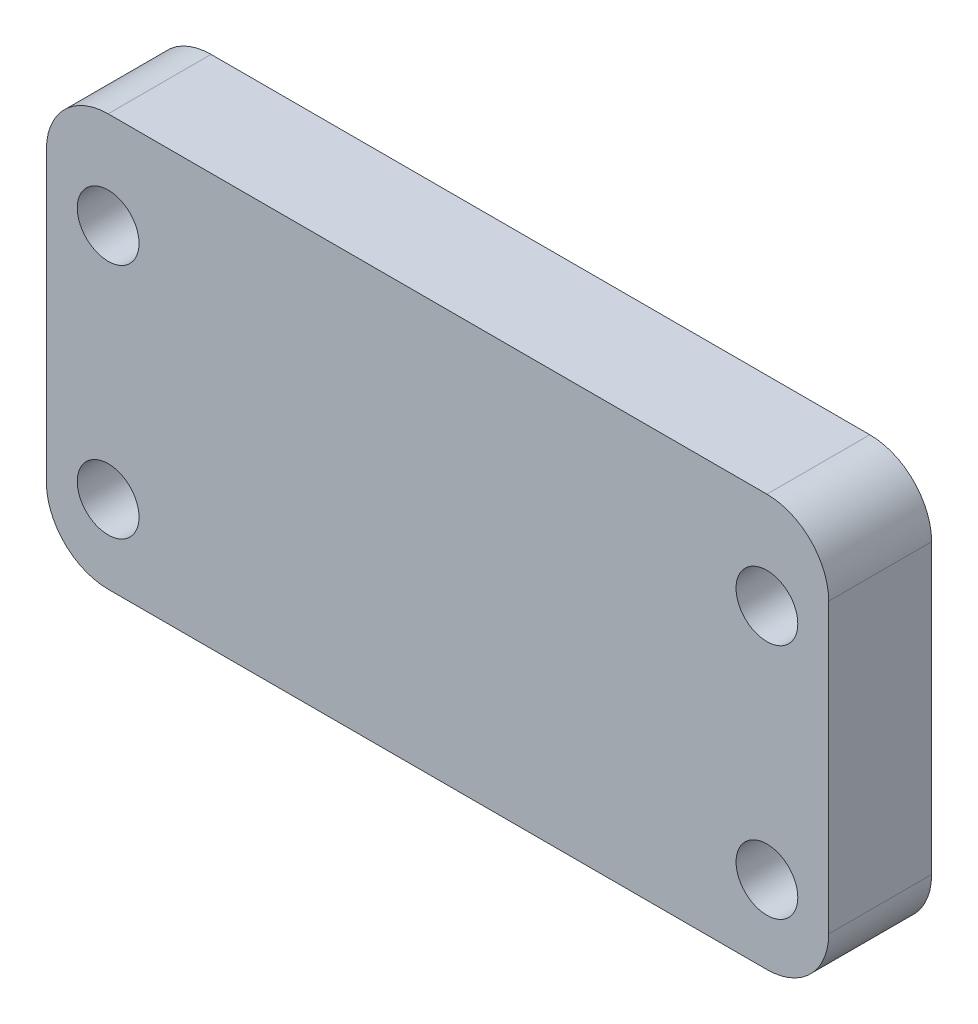
ISO-10303-21;
HEADER;
FILE_DESCRIPTION(('STEP AP214'),'2;1');
FILE_NAME('part.step','',(''),(''),'','','');
FILE_SCHEMA(('AUTOMOTIVE_DESIGN { 1 0 10303 214 1 1 1 1 }'));
ENDSEC;
DATA;
#1=APPLICATION_CONTEXT('core data for automotive mechanical design processes');
#2=APPLICATION_PROTOCOL_DEFINITION('international standard','automotive_design',2000,#1);
#3=PRODUCT_CONTEXT('',#1,'mechanical');
#4=PRODUCT('Part','Part','',(#3));
#5=PRODUCT_RELATED_PRODUCT_CATEGORY('part','',(#4));
#6=PRODUCT_DEFINITION_FORMATION('','',#4);
#7=PRODUCT_DEFINITION_CONTEXT('part definition',#1,'design');
#8=PRODUCT_DEFINITION('design','',#6,#7);
#9=PRODUCT_DEFINITION_SHAPE('','',#8);
#10=(LENGTH_UNIT() NAMED_UNIT(*) SI_UNIT(.MILLI.,.METRE.));
#11=(NAMED_UNIT(*) PLANE_ANGLE_UNIT() SI_UNIT($,.RADIAN.));
#12=(NAMED_UNIT(*) SI_UNIT($,.STERADIAN.) SOLID_ANGLE_UNIT());
#13=UNCERTAINTY_MEASURE_WITH_UNIT(LENGTH_MEASURE(1.E-05),#10,'distance_accuracy_value','');
#14=(GEOMETRIC_REPRESENTATION_CONTEXT(3) GLOBAL_UNCERTAINTY_ASSIGNED_CONTEXT((#13)) GLOBAL_UNIT_ASSIGNED_CONTEXT((#10,
#11,#12)) REPRESENTATION_CONTEXT('',''));
#15=CARTESIAN_POINT('',(0.,0.,0.));
#16=DIRECTION('',(0.,0.,1.));
#17=DIRECTION('',(1.,0.,0.));
#18=AXIS2_PLACEMENT_3D('',#15,#16,#17);
#19=CARTESIAN_POINT('',(-11.1107491856678,16.8664495114006,5.));
#20=DIRECTION('',(0.,0.,1.));
#21=DIRECTION('',(1.,0.,0.));
#22=AXIS2_PLACEMENT_3D('',#19,#20,#21);
#23=CYLINDRICAL_SURFACE('',#22,3.);
#24=DIRECTION('',(0.,0.,1.));
#25=VECTOR('',#24,1.);
#26=CARTESIAN_POINT('',(-11.1107491856678,19.8664495114006,5.));
#27=LINE('',#26,#25);
#28=CARTESIAN_POINT('',(-11.1107491856678,19.8664495114006,0.));
#29=VERTEX_POINT('',#28);
#30=CARTESIAN_POINT('',(-11.1107491856678,19.8664495114006,5.));
#31=VERTEX_POINT('',#30);
#32=EDGE_CURVE('E152',#29,#31,#27,.T.);
#33=ORIENTED_EDGE('',*,*,#32,.F.);
#34=CARTESIAN_POINT('',(-11.1107491856678,16.8664495114006,0.));
#35=DIRECTION('',(0.,0.,-1.));
#36=DIRECTION('',(-1.,0.,0.));
#37=AXIS2_PLACEMENT_3D('',#34,#35,#36);
#38=CIRCLE('',#37,3.);
#39=CARTESIAN_POINT('',(-14.1107491856678,16.8664495114006,0.));
#40=VERTEX_POINT('',#39);
#41=EDGE_CURVE('E41',#40,#29,#38,.T.);
#42=ORIENTED_EDGE('',*,*,#41,.F.);
#43=DIRECTION('',(0.,0.,1.));
#44=VECTOR('',#43,1.);
#45=CARTESIAN_POINT('',(-14.1107491856678,16.8664495114006,5.));
#46=LINE('',#45,#44);
#47=CARTESIAN_POINT('',(-14.1107491856678,16.8664495114006,5.));
#48=VERTEX_POINT('',#47);
#49=EDGE_CURVE('E154',#48,#40,#46,.F.);
#50=ORIENTED_EDGE('',*,*,#49,.F.);
#51=CARTESIAN_POINT('',(-11.1107491856678,16.8664495114006,5.));
#52=DIRECTION('',(0.,0.,-1.));
#53=DIRECTION('',(-1.,0.,0.));
#54=AXIS2_PLACEMENT_3D('',#51,#52,#53);
#55=CIRCLE('',#54,3.);
#56=EDGE_CURVE('E11',#31,#48,#55,.F.);
#57=ORIENTED_EDGE('',*,*,#56,.F.);
#58=EDGE_LOOP('',(#33,#42,#50,#57));
#59=FACE_BOUND('',#58,.T.);
#60=ADVANCED_FACE('F34',(#59),#23,.T.);
#61=CARTESIAN_POINT('',(-11.1107491856678,2.86644951140064,5.));
#62=DIRECTION('',(0.,0.,-1.));
#63=DIRECTION('',(-1.,0.,0.));
#64=AXIS2_PLACEMENT_3D('',#61,#62,#63);
#65=CYLINDRICAL_SURFACE('',#64,3.);
#66=DIRECTION('',(0.,0.,-1.));
#67=VECTOR('',#66,1.);
#68=CARTESIAN_POINT('',(-11.1107491856678,-0.133550488599359,5.));
#69=LINE('',#68,#67);
#70=CARTESIAN_POINT('',(-11.1107491856678,-0.133550488599359,5.));
#71=VERTEX_POINT('',#70);
#72=CARTESIAN_POINT('',(-11.1107491856678,-0.133550488599359,0.));
#73=VERTEX_POINT('',#72);
#74=EDGE_CURVE('E141',#71,#73,#69,.T.);
#75=ORIENTED_EDGE('',*,*,#74,.F.);
#76=CARTESIAN_POINT('',(-11.1107491856678,2.86644951140064,5.));
#77=DIRECTION('',(0.,0.,-1.));
#78=DIRECTION('',(-1.,0.,0.));
#79=AXIS2_PLACEMENT_3D('',#76,#77,#78);
#80=CIRCLE('',#79,3.);
#81=CARTESIAN_POINT('',(-14.1107491856678,2.86644951140064,5.));
#82=VERTEX_POINT('',#81);
#83=EDGE_CURVE('E147',#82,#71,#80,.F.);
#84=ORIENTED_EDGE('',*,*,#83,.F.);
#85=DIRECTION('',(0.,0.,-1.));
#86=VECTOR('',#85,1.);
#87=CARTESIAN_POINT('',(-14.1107491856678,2.86644951140064,5.));
#88=LINE('',#87,#86);
#89=CARTESIAN_POINT('',(-14.1107491856678,2.86644951140064,0.));
#90=VERTEX_POINT('',#89);
#91=EDGE_CURVE('E144',#90,#82,#88,.F.);
#92=ORIENTED_EDGE('',*,*,#91,.F.);
#93=CARTESIAN_POINT('',(-11.1107491856678,2.86644951140064,0.));
#94=DIRECTION('',(0.,0.,-1.));
#95=DIRECTION('',(-1.,0.,0.));
#96=AXIS2_PLACEMENT_3D('',#93,#94,#95);
#97=CIRCLE('',#96,3.);
#98=EDGE_CURVE('E149',#73,#90,#97,.T.);
#99=ORIENTED_EDGE('',*,*,#98,.F.);
#100=EDGE_LOOP('',(#75,#84,#92,#99));
#101=FACE_BOUND('',#100,.T.);
#102=ADVANCED_FACE('F209',(#101),#65,.T.);
#103=CARTESIAN_POINT('',(20.8892508143322,2.86644951140064,5.));
#104=DIRECTION('',(0.,0.,-1.));
#105=DIRECTION('',(-1.,0.,0.));
#106=AXIS2_PLACEMENT_3D('',#103,#104,#105);
#107=CYLINDRICAL_SURFACE('',#106,3.);
#108=DIRECTION('',(0.,0.,-1.));
#109=VECTOR('',#108,1.);
#110=CARTESIAN_POINT('',(23.8892508143322,2.86644951140064,5.));
#111=LINE('',#110,#109);
#112=CARTESIAN_POINT('',(23.8892508143322,2.86644951140064,5.));
#113=VERTEX_POINT('',#112);
#114=CARTESIAN_POINT('',(23.8892508143322,2.86644951140064,0.));
#115=VERTEX_POINT('',#114);
#116=EDGE_CURVE('E107',#113,#115,#111,.T.);
#117=ORIENTED_EDGE('',*,*,#116,.F.);
#118=CARTESIAN_POINT('',(20.8892508143322,2.86644951140064,5.));
#119=DIRECTION('',(0.,0.,-1.));
#120=DIRECTION('',(-1.,0.,0.));
#121=AXIS2_PLACEMENT_3D('',#118,#119,#120);
#122=CIRCLE('',#121,3.);
#123=CARTESIAN_POINT('',(20.8892508143322,-0.133550488599359,5.));
#124=VERTEX_POINT('',#123);
#125=EDGE_CURVE('E136',#124,#113,#122,.F.);
#126=ORIENTED_EDGE('',*,*,#125,.F.);
#127=DIRECTION('',(0.,0.,-1.));
#128=VECTOR('',#127,1.);
#129=CARTESIAN_POINT('',(20.8892508143322,-0.133550488599359,5.));
#130=LINE('',#129,#128);
#131=CARTESIAN_POINT('',(20.8892508143322,-0.133550488599359,0.));
#132=VERTEX_POINT('',#131);
#133=EDGE_CURVE('E133',#132,#124,#130,.F.);
#134=ORIENTED_EDGE('',*,*,#133,.F.);
#135=CARTESIAN_POINT('',(20.8892508143322,2.86644951140064,0.));
#136=DIRECTION('',(0.,0.,-1.));
#137=DIRECTION('',(-1.,0.,0.));
#138=AXIS2_PLACEMENT_3D('',#135,#136,#137);
#139=CIRCLE('',#138,3.);
#140=EDGE_CURVE('E138',#115,#132,#139,.T.);
#141=ORIENTED_EDGE('',*,*,#140,.F.);
#142=EDGE_LOOP('',(#117,#126,#134,#141));
#143=FACE_BOUND('',#142,.T.);
#144=ADVANCED_FACE('F204',(#143),#107,.T.);
#145=CARTESIAN_POINT('',(20.8892508143322,16.8664495114006,5.));
#146=DIRECTION('',(0.,0.,-1.));
#147=DIRECTION('',(-1.,0.,0.));
#148=AXIS2_PLACEMENT_3D('',#145,#146,#147);
#149=CYLINDRICAL_SURFACE('',#148,3.);
#150=DIRECTION('',(0.,0.,-1.));
#151=VECTOR('',#150,1.);
#152=CARTESIAN_POINT('',(20.8892508143322,19.8664495114006,5.));
#153=LINE('',#152,#151);
#154=CARTESIAN_POINT('',(20.8892508143322,19.8664495114006,5.));
#155=VERTEX_POINT('',#154);
#156=CARTESIAN_POINT('',(20.8892508143322,19.8664495114006,0.));
#157=VERTEX_POINT('',#156);
#158=EDGE_CURVE('E100',#155,#157,#153,.T.);
#159=ORIENTED_EDGE('',*,*,#158,.F.);
#160=CARTESIAN_POINT('',(20.8892508143322,16.8664495114006,5.));
#161=DIRECTION('',(0.,0.,-1.));
#162=DIRECTION('',(-1.,0.,0.));
#163=AXIS2_PLACEMENT_3D('',#160,#161,#162);
#164=CIRCLE('',#163,3.);
#165=CARTESIAN_POINT('',(23.8892508143322,16.8664495114006,5.));
#166=VERTEX_POINT('',#165);
#167=EDGE_CURVE('E108',#166,#155,#164,.F.);
#168=ORIENTED_EDGE('',*,*,#167,.F.);
#169=DIRECTION('',(0.,0.,-1.));
#170=VECTOR('',#169,1.);
#171=CARTESIAN_POINT('',(23.8892508143322,16.8664495114006,5.));
#172=LINE('',#171,#170);
#173=CARTESIAN_POINT('',(23.8892508143322,16.8664495114006,0.));
#174=VERTEX_POINT('',#173);
#175=EDGE_CURVE('E103',#174,#166,#172,.F.);
#176=ORIENTED_EDGE('',*,*,#175,.F.);
#177=CARTESIAN_POINT('',(20.8892508143322,16.8664495114006,0.));
#178=DIRECTION('',(0.,0.,-1.));
#179=DIRECTION('',(-1.,0.,0.));
#180=AXIS2_PLACEMENT_3D('',#177,#178,#179);
#181=CIRCLE('',#180,3.);
#182=EDGE_CURVE('E96',#157,#174,#181,.T.);
#183=ORIENTED_EDGE('',*,*,#182,.F.);
#184=EDGE_LOOP('',(#159,#168,#176,#183));
#185=FACE_BOUND('',#184,.T.);
#186=ADVANCED_FACE('F98',(#185),#149,.T.);
#187=CARTESIAN_POINT('',(0.,0.,5.));
#188=DIRECTION('',(0.,0.,-1.));
#189=DIRECTION('',(-1.,0.,0.));
#190=AXIS2_PLACEMENT_3D('',#187,#188,#189);
#191=PLANE('',#190);
#192=DIRECTION('',(-1.,0.,0.));
#193=VECTOR('',#192,1.);
#194=CARTESIAN_POINT('',(-14.1107491856678,19.8664495114006,5.));
#195=LINE('',#194,#193);
#196=EDGE_CURVE('E115',#155,#31,#195,.T.);
#197=ORIENTED_EDGE('',*,*,#196,.T.);
#198=ORIENTED_EDGE('',*,*,#56,.T.);
#199=DIRECTION('',(0.,-1.,0.));
#200=VECTOR('',#199,1.);
#201=CARTESIAN_POINT('',(-14.1107491856678,-0.133550488599359,5.));
#202=LINE('',#201,#200);
#203=EDGE_CURVE('E120',#48,#82,#202,.T.);
#204=ORIENTED_EDGE('',*,*,#203,.T.);
#205=ORIENTED_EDGE('',*,*,#83,.T.);
#206=DIRECTION('',(1.,0.,0.));
#207=VECTOR('',#206,1.);
#208=CARTESIAN_POINT('',(-14.1107491856678,-0.133550488599359,5.));
#209=LINE('',#208,#207);
#210=EDGE_CURVE('E123',#71,#124,#209,.T.);
#211=ORIENTED_EDGE('',*,*,#210,.T.);
#212=ORIENTED_EDGE('',*,*,#125,.T.);
#213=DIRECTION('',(0.,1.,0.));
#214=VECTOR('',#213,1.);
#215=CARTESIAN_POINT('',(23.8892508143322,-0.133550488599359,5.));
#216=LINE('',#215,#214);
#217=EDGE_CURVE('E168',#113,#166,#216,.T.);
#218=ORIENTED_EDGE('',*,*,#217,.T.);
#219=ORIENTED_EDGE('',*,*,#167,.T.);
#220=EDGE_LOOP('',(#197,#198,#204,#205,#211,#212,#218,#219));
#221=FACE_BOUND('',#220,.T.);
#222=CARTESIAN_POINT('',(-11.1107491856678,15.1628664495114,5.));
#223=DIRECTION('',(0.,0.,1.));
#224=DIRECTION('',(1.,0.,0.));
#225=AXIS2_PLACEMENT_3D('',#222,#223,#224);
#226=CIRCLE('',#225,1.5);
#227=CARTESIAN_POINT('',(-9.61074918566776,15.1628664495114,5.));
#228=VERTEX_POINT('',#227);
#229=EDGE_CURVE('E161',#228,#228,#226,.T.);
#230=ORIENTED_EDGE('',*,*,#229,.F.);
#231=EDGE_LOOP('',(#230));
#232=FACE_BOUND('',#231,.T.);
#233=CARTESIAN_POINT('',(-11.1107491856678,3.65146579804561,5.));
#234=DIRECTION('',(0.,0.,1.));
#235=DIRECTION('',(1.,0.,0.));
#236=AXIS2_PLACEMENT_3D('',#233,#234,#235);
#237=CIRCLE('',#236,1.5);
#238=CARTESIAN_POINT('',(-9.61074918566776,3.65146579804561,5.));
#239=VERTEX_POINT('',#238);
#240=EDGE_CURVE('E172',#239,#239,#237,.T.);
#241=ORIENTED_EDGE('',*,*,#240,.F.);
#242=EDGE_LOOP('',(#241));
#243=FACE_BOUND('',#242,.T.);
#244=CARTESIAN_POINT('',(20.8892508143322,15.1628664495114,5.));
#245=DIRECTION('',(0.,0.,1.));
#246=DIRECTION('',(1.,0.,0.));
#247=AXIS2_PLACEMENT_3D('',#244,#245,#246);
#248=CIRCLE('',#247,1.5);
#249=CARTESIAN_POINT('',(22.3892508143322,15.1628664495114,5.));
#250=VERTEX_POINT('',#249);
#251=EDGE_CURVE('E177',#250,#250,#248,.T.);
#252=ORIENTED_EDGE('',*,*,#251,.F.);
#253=EDGE_LOOP('',(#252));
#254=FACE_BOUND('',#253,.T.);
#255=CARTESIAN_POINT('',(20.8892508143322,3.65146579804561,5.));
#256=DIRECTION('',(0.,0.,1.));
#257=DIRECTION('',(1.,0.,0.));
#258=AXIS2_PLACEMENT_3D('',#255,#256,#257);
#259=CIRCLE('',#258,1.5);
#260=CARTESIAN_POINT('',(22.3892508143322,3.65146579804561,5.));
#261=VERTEX_POINT('',#260);
#262=EDGE_CURVE('E183',#261,#261,#259,.T.);
#263=ORIENTED_EDGE('',*,*,#262,.F.);
#264=EDGE_LOOP('',(#263));
#265=FACE_BOUND('',#264,.T.);
#266=ADVANCED_FACE('F195',(#221,#232,#243,#254,#265),#191,.F.);
#267=CARTESIAN_POINT('',(0.,0.,0.));
#268=DIRECTION('',(0.,0.,-1.));
#269=DIRECTION('',(-1.,0.,0.));
#270=AXIS2_PLACEMENT_3D('',#267,#268,#269);
#271=PLANE('',#270);
#272=CARTESIAN_POINT('',(20.8892508143322,15.1628664495114,0.));
#273=DIRECTION('',(0.,0.,1.));
#274=DIRECTION('',(1.,0.,0.));
#275=AXIS2_PLACEMENT_3D('',#272,#273,#274);
#276=CIRCLE('',#275,1.5);
#277=CARTESIAN_POINT('',(22.3892508143322,15.1628664495114,0.));
#278=VERTEX_POINT('',#277);
#279=EDGE_CURVE('E180',#278,#278,#276,.T.);
#280=ORIENTED_EDGE('',*,*,#279,.T.);
#281=EDGE_LOOP('',(#280));
#282=FACE_BOUND('',#281,.T.);
#283=CARTESIAN_POINT('',(-11.1107491856678,15.1628664495114,0.));
#284=DIRECTION('',(0.,0.,1.));
#285=DIRECTION('',(1.,0.,0.));
#286=AXIS2_PLACEMENT_3D('',#283,#284,#285);
#287=CIRCLE('',#286,1.5);
#288=CARTESIAN_POINT('',(-9.61074918566776,15.1628664495114,0.));
#289=VERTEX_POINT('',#288);
#290=EDGE_CURVE('E164',#289,#289,#287,.T.);
#291=ORIENTED_EDGE('',*,*,#290,.T.);
#292=EDGE_LOOP('',(#291));
#293=FACE_BOUND('',#292,.T.);
#294=DIRECTION('',(0.,-1.,0.));
#295=VECTOR('',#294,1.);
#296=CARTESIAN_POINT('',(-14.1107491856678,-0.133550488599359,0.));
#297=LINE('',#296,#295);
#298=EDGE_CURVE('E158',#40,#90,#297,.T.);
#299=ORIENTED_EDGE('',*,*,#298,.F.);
#300=ORIENTED_EDGE('',*,*,#41,.T.);
#301=DIRECTION('',(-1.,0.,0.));
#302=VECTOR('',#301,1.);
#303=CARTESIAN_POINT('',(-14.1107491856678,19.8664495114006,0.));
#304=LINE('',#303,#302);
#305=EDGE_CURVE('E114',#157,#29,#304,.T.);
#306=ORIENTED_EDGE('',*,*,#305,.F.);
#307=ORIENTED_EDGE('',*,*,#182,.T.);
#308=DIRECTION('',(0.,1.,0.));
#309=VECTOR('',#308,1.);
#310=CARTESIAN_POINT('',(23.8892508143322,-0.133550488599359,0.));
#311=LINE('',#310,#309);
#312=EDGE_CURVE('E121',#115,#174,#311,.T.);
#313=ORIENTED_EDGE('',*,*,#312,.F.);
#314=ORIENTED_EDGE('',*,*,#140,.T.);
#315=DIRECTION('',(1.,0.,0.));
#316=VECTOR('',#315,1.);
#317=CARTESIAN_POINT('',(-14.1107491856678,-0.133550488599359,0.));
#318=LINE('',#317,#316);
#319=EDGE_CURVE('E125',#73,#132,#318,.T.);
#320=ORIENTED_EDGE('',*,*,#319,.F.);
#321=ORIENTED_EDGE('',*,*,#98,.T.);
#322=EDGE_LOOP('',(#299,#300,#306,#307,#313,#314,#320,#321));
#323=FACE_BOUND('',#322,.T.);
#324=CARTESIAN_POINT('',(-11.1107491856678,3.65146579804561,0.));
#325=DIRECTION('',(0.,0.,1.));
#326=DIRECTION('',(1.,0.,0.));
#327=AXIS2_PLACEMENT_3D('',#324,#325,#326);
#328=CIRCLE('',#327,1.5);
#329=CARTESIAN_POINT('',(-9.61074918566776,3.65146579804561,0.));
#330=VERTEX_POINT('',#329);
#331=EDGE_CURVE('E174',#330,#330,#328,.T.);
#332=ORIENTED_EDGE('',*,*,#331,.T.);
#333=EDGE_LOOP('',(#332));
#334=FACE_BOUND('',#333,.T.);
#335=CARTESIAN_POINT('',(20.8892508143322,3.65146579804561,0.));
#336=DIRECTION('',(0.,0.,1.));
#337=DIRECTION('',(1.,0.,0.));
#338=AXIS2_PLACEMENT_3D('',#335,#336,#337);
#339=CIRCLE('',#338,1.5);
#340=CARTESIAN_POINT('',(22.3892508143322,3.65146579804561,0.));
#341=VERTEX_POINT('',#340);
#342=EDGE_CURVE('E186',#341,#341,#339,.T.);
#343=ORIENTED_EDGE('',*,*,#342,.T.);
#344=EDGE_LOOP('',(#343));
#345=FACE_BOUND('',#344,.T.);
#346=ADVANCED_FACE('F118',(#282,#293,#323,#334,#345),#271,.T.);
#347=CARTESIAN_POINT('',(-14.1107491856678,-0.133550488599359,5.));
#348=DIRECTION('',(1.,0.,0.));
#349=DIRECTION('',(0.,1.,0.));
#350=AXIS2_PLACEMENT_3D('',#347,#348,#349);
#351=PLANE('',#350);
#352=ORIENTED_EDGE('',*,*,#203,.F.);
#353=ORIENTED_EDGE('',*,*,#49,.T.);
#354=ORIENTED_EDGE('',*,*,#298,.T.);
#355=ORIENTED_EDGE('',*,*,#91,.T.);
#356=EDGE_LOOP('',(#352,#353,#354,#355));
#357=FACE_BOUND('',#356,.T.);
#358=ADVANCED_FACE('F157',(#357),#351,.F.);
#359=CARTESIAN_POINT('',(-14.1107491856678,-0.133550488599359,5.));
#360=DIRECTION('',(0.,1.,0.));
#361=DIRECTION('',(0.,0.,1.));
#362=AXIS2_PLACEMENT_3D('',#359,#360,#361);
#363=PLANE('',#362);
#364=ORIENTED_EDGE('',*,*,#210,.F.);
#365=ORIENTED_EDGE('',*,*,#74,.T.);
#366=ORIENTED_EDGE('',*,*,#319,.T.);
#367=ORIENTED_EDGE('',*,*,#133,.T.);
#368=EDGE_LOOP('',(#364,#365,#366,#367));
#369=FACE_BOUND('',#368,.T.);
#370=ADVANCED_FACE('F223',(#369),#363,.F.);
#371=CARTESIAN_POINT('',(23.8892508143322,-0.133550488599359,5.));
#372=DIRECTION('',(-1.,0.,0.));
#373=DIRECTION('',(0.,0.,1.));
#374=AXIS2_PLACEMENT_3D('',#371,#372,#373);
#375=PLANE('',#374);
#376=ORIENTED_EDGE('',*,*,#217,.F.);
#377=ORIENTED_EDGE('',*,*,#116,.T.);
#378=ORIENTED_EDGE('',*,*,#312,.T.);
#379=ORIENTED_EDGE('',*,*,#175,.T.);
#380=EDGE_LOOP('',(#376,#377,#378,#379));
#381=FACE_BOUND('',#380,.T.);
#382=ADVANCED_FACE('F216',(#381),#375,.F.);
#383=CARTESIAN_POINT('',(-14.1107491856678,19.8664495114006,5.));
#384=DIRECTION('',(0.,-1.,0.));
#385=DIRECTION('',(0.,0.,-1.));
#386=AXIS2_PLACEMENT_3D('',#383,#384,#385);
#387=PLANE('',#386);
#388=ORIENTED_EDGE('',*,*,#305,.T.);
#389=ORIENTED_EDGE('',*,*,#32,.T.);
#390=ORIENTED_EDGE('',*,*,#196,.F.);
#391=ORIENTED_EDGE('',*,*,#158,.T.);
#392=EDGE_LOOP('',(#388,#389,#390,#391));
#393=FACE_BOUND('',#392,.T.);
#394=ADVANCED_FACE('F112',(#393),#387,.F.);
#395=CARTESIAN_POINT('',(-11.1107491856678,15.1628664495114,5.));
#396=DIRECTION('',(0.,0.,-1.));
#397=DIRECTION('',(-1.,0.,0.));
#398=AXIS2_PLACEMENT_3D('',#395,#396,#397);
#399=CYLINDRICAL_SURFACE('',#398,1.5);
#400=ORIENTED_EDGE('',*,*,#229,.T.);
#401=EDGE_LOOP('',(#400));
#402=FACE_BOUND('',#401,.T.);
#403=ORIENTED_EDGE('',*,*,#290,.F.);
#404=EDGE_LOOP('',(#403));
#405=FACE_BOUND('',#404,.T.);
#406=ADVANCED_FACE('F274',(#402,#405),#399,.F.);
#407=CARTESIAN_POINT('',(-11.1107491856678,3.65146579804561,5.));
#408=DIRECTION('',(0.,0.,-1.));
#409=DIRECTION('',(-1.,0.,0.));
#410=AXIS2_PLACEMENT_3D('',#407,#408,#409);
#411=CYLINDRICAL_SURFACE('',#410,1.5);
#412=ORIENTED_EDGE('',*,*,#240,.T.);
#413=EDGE_LOOP('',(#412));
#414=FACE_BOUND('',#413,.T.);
#415=ORIENTED_EDGE('',*,*,#331,.F.);
#416=EDGE_LOOP('',(#415));
#417=FACE_BOUND('',#416,.T.);
#418=ADVANCED_FACE('F264',(#414,#417),#411,.F.);
#419=CARTESIAN_POINT('',(20.8892508143322,15.1628664495114,5.));
#420=DIRECTION('',(0.,0.,-1.));
#421=DIRECTION('',(-1.,0.,0.));
#422=AXIS2_PLACEMENT_3D('',#419,#420,#421);
#423=CYLINDRICAL_SURFACE('',#422,1.5);
#424=ORIENTED_EDGE('',*,*,#251,.T.);
#425=EDGE_LOOP('',(#424));
#426=FACE_BOUND('',#425,.T.);
#427=ORIENTED_EDGE('',*,*,#279,.F.);
#428=EDGE_LOOP('',(#427));
#429=FACE_BOUND('',#428,.T.);
#430=ADVANCED_FACE('F255',(#426,#429),#423,.F.);
#431=CARTESIAN_POINT('',(20.8892508143322,3.65146579804561,5.));
#432=DIRECTION('',(0.,0.,-1.));
#433=DIRECTION('',(-1.,0.,0.));
#434=AXIS2_PLACEMENT_3D('',#431,#432,#433);
#435=CYLINDRICAL_SURFACE('',#434,1.5);
#436=ORIENTED_EDGE('',*,*,#262,.T.);
#437=EDGE_LOOP('',(#436));
#438=FACE_BOUND('',#437,.T.);
#439=ORIENTED_EDGE('',*,*,#342,.F.);
#440=EDGE_LOOP('',(#439));
#441=FACE_BOUND('',#440,.T.);
#442=ADVANCED_FACE('F192',(#438,#441),#435,.F.);
#443=CLOSED_SHELL('',(#60,#102,#144,#186,#266,#346,#358,#370,#382,#394,#406,#418,#430,#442));
#444=MANIFOLD_SOLID_BREP('B2',#443);
#445=ADVANCED_BREP_SHAPE_REPRESENTATION('',(#18,#444),#14);
#446=SHAPE_DEFINITION_REPRESENTATION(#9,#445);
ENDSEC;
END-ISO-10303-21;
